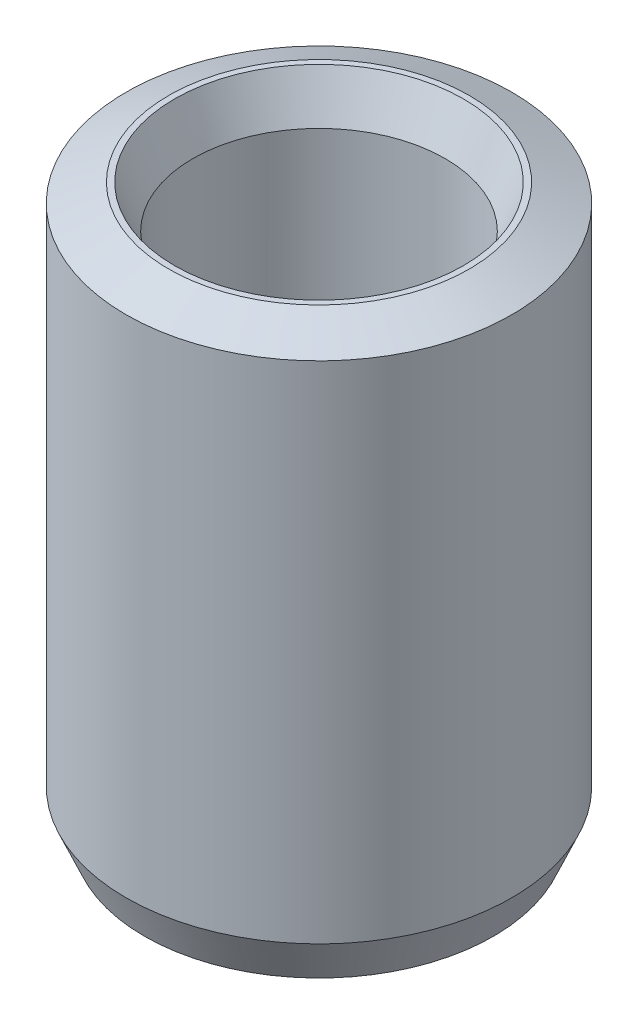
ISO-10303-21;
HEADER;
FILE_DESCRIPTION(('STEP AP214'),'2;1');
FILE_NAME('part.step','',(''),(''),'','','');
FILE_SCHEMA(('AUTOMOTIVE_DESIGN { 1 0 10303 214 1 1 1 1 }'));
ENDSEC;
DATA;
#1=APPLICATION_CONTEXT('core data for automotive mechanical design processes');
#2=APPLICATION_PROTOCOL_DEFINITION('international standard','automotive_design',2000,#1);
#3=PRODUCT_CONTEXT('',#1,'mechanical');
#4=PRODUCT('Part','Part','',(#3));
#5=PRODUCT_RELATED_PRODUCT_CATEGORY('part','',(#4));
#6=PRODUCT_DEFINITION_FORMATION('','',#4);
#7=PRODUCT_DEFINITION_CONTEXT('part definition',#1,'design');
#8=PRODUCT_DEFINITION('design','',#6,#7);
#9=PRODUCT_DEFINITION_SHAPE('','',#8);
#10=(LENGTH_UNIT() NAMED_UNIT(*) SI_UNIT(.MILLI.,.METRE.));
#11=(NAMED_UNIT(*) PLANE_ANGLE_UNIT() SI_UNIT($,.RADIAN.));
#12=(NAMED_UNIT(*) SI_UNIT($,.STERADIAN.) SOLID_ANGLE_UNIT());
#13=UNCERTAINTY_MEASURE_WITH_UNIT(LENGTH_MEASURE(1.E-05),#10,'distance_accuracy_value','');
#14=(GEOMETRIC_REPRESENTATION_CONTEXT(3) GLOBAL_UNCERTAINTY_ASSIGNED_CONTEXT((#13)) GLOBAL_UNIT_ASSIGNED_CONTEXT((#10,
#11,#12)) REPRESENTATION_CONTEXT('',''));
#15=CARTESIAN_POINT('',(0.,0.,0.));
#16=DIRECTION('',(0.,0.,1.));
#17=DIRECTION('',(1.,0.,0.));
#18=AXIS2_PLACEMENT_3D('',#15,#16,#17);
#19=CARTESIAN_POINT('',(0.,102.684958092858,0.));
#20=DIRECTION('',(0.,-1.,0.));
#21=DIRECTION('',(0.,0.,-1.));
#22=AXIS2_PLACEMENT_3D('',#19,#20,#21);
#23=CYLINDRICAL_SURFACE('',#22,35.);
#24=CARTESIAN_POINT('',(0.,7.71480416026316,0.));
#25=DIRECTION('',(0.,1.,0.));
#26=DIRECTION('',(0.,0.,1.));
#27=AXIS2_PLACEMENT_3D('',#24,#25,#26);
#28=CIRCLE('',#27,35.);
#29=CARTESIAN_POINT('',(0.,7.71480416026316,35.));
#30=VERTEX_POINT('',#29);
#31=EDGE_CURVE('E10',#30,#30,#28,.T.);
#32=ORIENTED_EDGE('',*,*,#31,.T.);
#33=EDGE_LOOP('',(#32));
#34=FACE_BOUND('',#33,.T.);
#35=CARTESIAN_POINT('',(0.,99.358945268844,0.));
#36=DIRECTION('',(0.,1.,0.));
#37=DIRECTION('',(0.,0.,1.));
#38=AXIS2_PLACEMENT_3D('',#35,#36,#37);
#39=CIRCLE('',#38,35.);
#40=CARTESIAN_POINT('',(0.,99.3589452688439,-35.));
#41=VERTEX_POINT('',#40);
#42=EDGE_CURVE('E50',#41,#41,#39,.F.);
#43=ORIENTED_EDGE('',*,*,#42,.T.);
#44=EDGE_LOOP('',(#43));
#45=FACE_BOUND('',#44,.T.);
#46=ADVANCED_FACE('F39',(#34,#45),#23,.T.);
#47=CARTESIAN_POINT('',(0.,102.684958092858,0.));
#48=DIRECTION('',(0.,1.,0.));
#49=DIRECTION('',(0.,0.,1.));
#50=AXIS2_PLACEMENT_3D('',#47,#48,#49);
#51=PLANE('',#50);
#52=CARTESIAN_POINT('',(0.,102.684958092858,0.));
#53=DIRECTION('',(0.,1.,0.));
#54=DIRECTION('',(0.,0.,1.));
#55=AXIS2_PLACEMENT_3D('',#52,#53,#54);
#56=CIRCLE('',#55,26.2177838068293);
#57=CARTESIAN_POINT('',(0.,102.684958092858,26.2177838068293));
#58=VERTEX_POINT('',#57);
#59=EDGE_CURVE('E58',#58,#58,#56,.F.);
#60=ORIENTED_EDGE('',*,*,#59,.T.);
#61=EDGE_LOOP('',(#60));
#62=FACE_BOUND('',#61,.T.);
#63=CARTESIAN_POINT('',(0.,102.684958092858,0.));
#64=DIRECTION('',(0.,1.,0.));
#65=DIRECTION('',(0.,0.,1.));
#66=AXIS2_PLACEMENT_3D('',#63,#64,#65);
#67=CIRCLE('',#66,27.2851958397369);
#68=CARTESIAN_POINT('',(0.,102.684958092858,-27.2851958397369));
#69=VERTEX_POINT('',#68);
#70=EDGE_CURVE('E61',#69,#69,#67,.T.);
#71=ORIENTED_EDGE('',*,*,#70,.T.);
#72=EDGE_LOOP('',(#71));
#73=FACE_BOUND('',#72,.T.);
#74=ADVANCED_FACE('F88',(#62,#73),#51,.T.);
#75=CARTESIAN_POINT('',(0.,0.,0.));
#76=DIRECTION('',(0.,1.,0.));
#77=DIRECTION('',(0.,0.,1.));
#78=AXIS2_PLACEMENT_3D('',#75,#76,#77);
#79=PLANE('',#78);
#80=CARTESIAN_POINT('',(0.,0.,0.));
#81=DIRECTION('',(0.,1.,0.));
#82=DIRECTION('',(0.,0.,1.));
#83=AXIS2_PLACEMENT_3D('',#80,#81,#82);
#84=CIRCLE('',#83,30.6065751430781);
#85=CARTESIAN_POINT('',(0.,0.,-30.6065751430781));
#86=VERTEX_POINT('',#85);
#87=EDGE_CURVE('E51',#86,#86,#84,.T.);
#88=ORIENTED_EDGE('',*,*,#87,.T.);
#89=EDGE_LOOP('',(#88));
#90=FACE_BOUND('',#89,.T.);
#91=CARTESIAN_POINT('',(0.,0.,0.));
#92=DIRECTION('',(0.,1.,0.));
#93=DIRECTION('',(0.,0.,1.));
#94=AXIS2_PLACEMENT_3D('',#91,#92,#93);
#95=CIRCLE('',#94,31.6739871759856);
#96=CARTESIAN_POINT('',(0.,0.,31.6739871759856));
#97=VERTEX_POINT('',#96);
#98=EDGE_CURVE('E54',#97,#97,#95,.F.);
#99=ORIENTED_EDGE('',*,*,#98,.T.);
#100=EDGE_LOOP('',(#99));
#101=FACE_BOUND('',#100,.T.);
#102=ADVANCED_FACE('F83',(#90,#101),#79,.F.);
#103=CARTESIAN_POINT('',(0.,102.684958092858,0.));
#104=DIRECTION('',(0.,-1.,0.));
#105=DIRECTION('',(0.,0.,-1.));
#106=AXIS2_PLACEMENT_3D('',#103,#104,#105);
#107=CYLINDRICAL_SURFACE('',#106,22.8917709828149);
#108=CARTESIAN_POINT('',(0.,94.9701539325952,0.));
#109=DIRECTION('',(0.,1.,0.));
#110=DIRECTION('',(0.,0.,1.));
#111=AXIS2_PLACEMENT_3D('',#108,#109,#110);
#112=CIRCLE('',#111,22.8917709828149);
#113=CARTESIAN_POINT('',(0.,94.9701539325952,22.8917709828149));
#114=VERTEX_POINT('',#113);
#115=EDGE_CURVE('E67',#114,#114,#112,.T.);
#116=ORIENTED_EDGE('',*,*,#115,.T.);
#117=EDGE_LOOP('',(#116));
#118=FACE_BOUND('',#117,.T.);
#119=CARTESIAN_POINT('',(0.,3.32601282401442,0.));
#120=DIRECTION('',(0.,1.,0.));
#121=DIRECTION('',(0.,0.,1.));
#122=AXIS2_PLACEMENT_3D('',#119,#120,#121);
#123=CIRCLE('',#122,22.8917709828149);
#124=CARTESIAN_POINT('',(0.,3.32601282401441,-22.8917709828149));
#125=VERTEX_POINT('',#124);
#126=EDGE_CURVE('E69',#125,#125,#123,.F.);
#127=ORIENTED_EDGE('',*,*,#126,.T.);
#128=EDGE_LOOP('',(#127));
#129=FACE_BOUND('',#128,.T.);
#130=ADVANCED_FACE('F71',(#118,#129),#107,.F.);
#131=CARTESIAN_POINT('',(0.,94.9701539325952,0.));
#132=DIRECTION('',(0.,1.,0.));
#133=DIRECTION('',(0.,0.,1.));
#134=AXIS2_PLACEMENT_3D('',#131,#132,#133);
#135=CONICAL_SURFACE('',#134,22.8917709828149,0.407043606954843);
#136=ORIENTED_EDGE('',*,*,#59,.F.);
#137=EDGE_LOOP('',(#136));
#138=FACE_BOUND('',#137,.T.);
#139=ORIENTED_EDGE('',*,*,#115,.F.);
#140=EDGE_LOOP('',(#139));
#141=FACE_BOUND('',#140,.T.);
#142=ADVANCED_FACE('F77',(#138,#141),#135,.F.);
#143=CARTESIAN_POINT('',(0.,0.,0.));
#144=DIRECTION('',(0.,-1.,0.));
#145=DIRECTION('',(0.,0.,-1.));
#146=AXIS2_PLACEMENT_3D('',#143,#144,#145);
#147=CONICAL_SURFACE('',#146,30.6065751430781,1.16375271984006);
#148=CARTESIAN_POINT('',(0.,3.32601282401441,-22.8917709828149));
#149=CARTESIAN_POINT('',(0.,3.2913668570976,-22.972133526151));
#150=CARTESIAN_POINT('',(0.,3.25672089018078,-23.052496069487));
#151=CARTESIAN_POINT('',(0.,3.18742895634715,-23.2132211561592));
#152=CARTESIAN_POINT('',(0.,3.15278298943033,-23.2935836994953));
#153=CARTESIAN_POINT('',(0.,3.0834910555967,-23.4543087861674));
#154=CARTESIAN_POINT('',(0.,3.04884508867988,-23.5346713295035));
#155=CARTESIAN_POINT('',(0.,2.97955315484625,-23.6953964161757));
#156=CARTESIAN_POINT('',(0.,2.94490718792943,-23.7757589595117));
#157=CARTESIAN_POINT('',(0.,2.8756152540958,-23.9364840461839));
#158=CARTESIAN_POINT('',(0.,2.84096928717898,-24.01684658952));
#159=CARTESIAN_POINT('',(0.,2.77167735334535,-24.1775716761921));
#160=CARTESIAN_POINT('',(0.,2.73703138642853,-24.2579342195282));
#161=CARTESIAN_POINT('',(0.,2.6677394525949,-24.4186593062003));
#162=CARTESIAN_POINT('',(0.,2.63309348567808,-24.4990218495364));
#163=CARTESIAN_POINT('',(0.,2.56380155184445,-24.6597469362085));
#164=CARTESIAN_POINT('',(0.,2.52915558492763,-24.7401094795446));
#165=CARTESIAN_POINT('',(0.,2.45986365109399,-24.9008345662168));
#166=CARTESIAN_POINT('',(0.,2.42521768417718,-24.9811971095528));
#167=CARTESIAN_POINT('',(0.,2.35592575034354,-25.141922196225));
#168=CARTESIAN_POINT('',(0.,2.32127978342673,-25.2222847395611));
#169=CARTESIAN_POINT('',(0.,2.25198784959309,-25.3830098262332));
#170=CARTESIAN_POINT('',(0.,2.21734188267628,-25.4633723695693));
#171=CARTESIAN_POINT('',(0.,2.14804994884264,-25.6240974562414));
#172=CARTESIAN_POINT('',(0.,2.11340398192583,-25.7044599995775));
#173=CARTESIAN_POINT('',(0.,2.04411204809219,-25.8651850862497));
#174=CARTESIAN_POINT('',(0.,2.00946608117538,-25.9455476295857));
#175=CARTESIAN_POINT('',(0.,1.94017414734174,-26.1062727162579));
#176=CARTESIAN_POINT('',(0.,1.90552818042493,-26.186635259594));
#177=CARTESIAN_POINT('',(0.,1.83623624659129,-26.3473603462661));
#178=CARTESIAN_POINT('',(0.,1.80159027967447,-26.4277228896022));
#179=CARTESIAN_POINT('',(0.,1.73229834584084,-26.5884479762743));
#180=CARTESIAN_POINT('',(0.,1.69765237892402,-26.6688105196104));
#181=CARTESIAN_POINT('',(0.,1.62836044509039,-26.8295356062826));
#182=CARTESIAN_POINT('',(0.,1.59371447817357,-26.9098981496186));
#183=CARTESIAN_POINT('',(0.,1.52442254433994,-27.0706232362908));
#184=CARTESIAN_POINT('',(0.,1.48977657742312,-27.1509857796269));
#185=CARTESIAN_POINT('',(0.,1.42048464358949,-27.311710866299));
#186=CARTESIAN_POINT('',(0.,1.38583867667267,-27.3920734096351));
#187=CARTESIAN_POINT('',(0.,1.31654674283904,-27.5527984963072));
#188=CARTESIAN_POINT('',(0.,1.28190077592222,-27.6331610396433));
#189=CARTESIAN_POINT('',(0.,1.21260884208859,-27.7938861263155));
#190=CARTESIAN_POINT('',(0.,1.17796287517177,-27.8742486696515));
#191=CARTESIAN_POINT('',(0.,1.10867094133814,-28.0349737563237));
#192=CARTESIAN_POINT('',(0.,1.07402497442132,-28.1153362996598));
#193=CARTESIAN_POINT('',(0.,1.00473304058769,-28.2760613863319));
#194=CARTESIAN_POINT('',(0.,0.970087073670871,-28.356423929668));
#195=CARTESIAN_POINT('',(0.,0.900795139837237,-28.5171490163401));
#196=CARTESIAN_POINT('',(0.,0.866149172920421,-28.5975115596762));
#197=CARTESIAN_POINT('',(0.,0.796857239086787,-28.7582366463484));
#198=CARTESIAN_POINT('',(0.,0.76221127216997,-28.8385991896844));
#199=CARTESIAN_POINT('',(0.,0.692919338336336,-28.9993242763566));
#200=CARTESIAN_POINT('',(0.,0.658273371419519,-29.0796868196927));
#201=CARTESIAN_POINT('',(0.,0.588981437585886,-29.2404119063648));
#202=CARTESIAN_POINT('',(0.,0.554335470669069,-29.3207744497009));
#203=CARTESIAN_POINT('',(0.,0.485043536835436,-29.481499536373));
#204=CARTESIAN_POINT('',(0.,0.450397569918619,-29.5618620797091));
#205=CARTESIAN_POINT('',(0.,0.381105636084985,-29.7225871663813));
#206=CARTESIAN_POINT('',(0.,0.346459669168168,-29.8029497097173));
#207=CARTESIAN_POINT('',(0.,0.277167735334535,-29.9636747963895));
#208=CARTESIAN_POINT('',(0.,0.242521768417718,-30.0440373397256));
#209=CARTESIAN_POINT('',(0.,0.173229834584084,-30.2047624263977));
#210=CARTESIAN_POINT('',(0.,0.138583867667267,-30.2851249697338));
#211=CARTESIAN_POINT('',(0.,0.069291933833634,-30.4458500564059));
#212=CARTESIAN_POINT('',(0.,0.0346459669168174,-30.526212599742));
#213=CARTESIAN_POINT('',(0.,0.,-30.6065751430781));
#214=B_SPLINE_CURVE_WITH_KNOTS('',3,(#148,#149,#150,#151,#152,#153,#154,#155,#156,#157,#158,
#159,#160,#161,#162,#163,#164,#165,#166,#167,#168,#169,#170,#171,#172,#173,#174,#175,#176,#177,
#178,#179,#180,#181,#182,#183,#184,#185,#186,#187,#188,#189,#190,#191,#192,#193,#194,#195,#196,
#197,#198,#199,#200,#201,#202,#203,#204,#205,#206,#207,#208,#209,#210,#211,#212,#213),
.UNSPECIFIED.,.F.,.F.,(4,2,2,2,2,2,2,2,2,2,2,2,2,2,2,2,2,2,2,2,2,2,2,2,2,2,2,2,2,2,2,2,4),(0.,
0.26253824969972,0.525076499399443,0.787614749099164,1.05015299879888,1.31269124849861,
1.57522949819833,1.83776774789805,2.10030599759777,2.36284424729749,2.62538249699721,
2.88792074669693,3.15045899639665,3.41299724609637,3.67553549579609,3.93807374549581,
4.20061199519554,4.46315024489526,4.72568849459498,4.9882267442947,5.25076499399442,
5.51330324369414,5.77584149339386,6.03837974309358,6.3009179927933,6.56345624249302,
6.82599449219274,7.08853274189247,7.35107099159219,7.6136092412919,7.87614749099163,
8.13868574069135,8.40122399039107),.UNSPECIFIED.);
#215=EDGE_CURVE('BSEAM73',#125,#86,#214,.T.);
#216=ORIENTED_EDGE('',*,*,#126,.F.);
#217=ORIENTED_EDGE('',*,*,#87,.F.);
#218=ORIENTED_EDGE('',*,*,#215,.T.);
#219=ORIENTED_EDGE('',*,*,#215,.F.);
#220=EDGE_LOOP('',(#216,#218,#217,#219));
#221=FACE_BOUND('',#220,.T.);
#222=ADVANCED_FACE('F73',(#221),#147,.F.);
#223=CARTESIAN_POINT('',(0.,7.71480416026316,0.));
#224=DIRECTION('',(0.,1.,0.));
#225=DIRECTION('',(0.,0.,1.));
#226=AXIS2_PLACEMENT_3D('',#223,#224,#225);
#227=CONICAL_SURFACE('',#226,35.,0.40704360695484);
#228=ORIENTED_EDGE('',*,*,#98,.F.);
#229=EDGE_LOOP('',(#228));
#230=FACE_BOUND('',#229,.T.);
#231=ORIENTED_EDGE('',*,*,#31,.F.);
#232=EDGE_LOOP('',(#231));
#233=FACE_BOUND('',#232,.T.);
#234=ADVANCED_FACE('F76',(#230,#233),#227,.T.);
#235=CARTESIAN_POINT('',(0.,102.684958092858,0.));
#236=DIRECTION('',(0.,-1.,0.));
#237=DIRECTION('',(0.,0.,-1.));
#238=AXIS2_PLACEMENT_3D('',#235,#236,#237);
#239=CONICAL_SURFACE('',#238,27.2851958397369,1.16375271984005);
#240=CARTESIAN_POINT('',(0.,99.3589452688439,-35.));
#241=CARTESIAN_POINT('',(0.,99.3935912357608,-34.919637456664));
#242=CARTESIAN_POINT('',(0.,99.4282372026776,-34.8392749133279));
#243=CARTESIAN_POINT('',(0.,99.4975291365112,-34.6785498266557));
#244=CARTESIAN_POINT('',(0.,99.532175103428,-34.5981872833197));
#245=CARTESIAN_POINT('',(0.,99.6014670372617,-34.4374621966475));
#246=CARTESIAN_POINT('',(0.,99.6361130041785,-34.3570996533114));
#247=CARTESIAN_POINT('',(0.,99.7054049380121,-34.1963745666393));
#248=CARTESIAN_POINT('',(0.,99.7400509049289,-34.1160120233032));
#249=CARTESIAN_POINT('',(0.,99.8093428387626,-33.9552869366311));
#250=CARTESIAN_POINT('',(0.,99.8439888056794,-33.874924393295));
#251=CARTESIAN_POINT('',(0.,99.913280739513,-33.7141993066228));
#252=CARTESIAN_POINT('',(0.,99.9479267064298,-33.6338367632868));
#253=CARTESIAN_POINT('',(0.,100.017218640263,-33.4731116766146));
#254=CARTESIAN_POINT('',(0.,100.05186460718,-33.3927491332785));
#255=CARTESIAN_POINT('',(0.,100.121156541014,-33.2320240466064));
#256=CARTESIAN_POINT('',(0.,100.155802507931,-33.1516615032703));
#257=CARTESIAN_POINT('',(0.,100.225094441764,-32.9909364165982));
#258=CARTESIAN_POINT('',(0.,100.259740408681,-32.9105738732621));
#259=CARTESIAN_POINT('',(0.,100.329032342515,-32.74984878659));
#260=CARTESIAN_POINT('',(0.,100.363678309432,-32.6694862432539));
#261=CARTESIAN_POINT('',(0.,100.432970243265,-32.5087611565817));
#262=CARTESIAN_POINT('',(0.,100.467616210182,-32.4283986132457));
#263=CARTESIAN_POINT('',(0.,100.536908144016,-32.2676735265735));
#264=CARTESIAN_POINT('',(0.,100.571554110933,-32.1873109832374));
#265=CARTESIAN_POINT('',(0.,100.640846044766,-32.0265858965653));
#266=CARTESIAN_POINT('',(0.,100.675492011683,-31.9462233532292));
#267=CARTESIAN_POINT('',(0.,100.744783945517,-31.7854982665571));
#268=CARTESIAN_POINT('',(0.,100.779429912433,-31.705135723221));
#269=CARTESIAN_POINT('',(0.,100.848721846267,-31.5444106365488));
#270=CARTESIAN_POINT('',(0.,100.883367813184,-31.4640480932128));
#271=CARTESIAN_POINT('',(0.,100.952659747018,-31.3033230065406));
#272=CARTESIAN_POINT('',(0.,100.987305713934,-31.2229604632045));
#273=CARTESIAN_POINT('',(0.,101.056597647768,-31.0622353765324));
#274=CARTESIAN_POINT('',(0.,101.091243614685,-30.9818728331963));
#275=CARTESIAN_POINT('',(0.,101.160535548518,-30.8211477465242));
#276=CARTESIAN_POINT('',(0.,101.195181515435,-30.7407852031881));
#277=CARTESIAN_POINT('',(0.,101.264473449269,-30.5800601165159));
#278=CARTESIAN_POINT('',(0.,101.299119416186,-30.4996975731799));
#279=CARTESIAN_POINT('',(0.,101.368411350019,-30.3389724865077));
#280=CARTESIAN_POINT('',(0.,101.403057316936,-30.2586099431716));
#281=CARTESIAN_POINT('',(0.,101.47234925077,-30.0978848564995));
#282=CARTESIAN_POINT('',(0.,101.506995217687,-30.0175223131634));
#283=CARTESIAN_POINT('',(0.,101.57628715152,-29.8567972264913));
#284=CARTESIAN_POINT('',(0.,101.610933118437,-29.7764346831552));
#285=CARTESIAN_POINT('',(0.,101.680225052271,-29.615709596483));
#286=CARTESIAN_POINT('',(0.,101.714871019187,-29.535347053147));
#287=CARTESIAN_POINT('',(0.,101.784162953021,-29.3746219664748));
#288=CARTESIAN_POINT('',(0.,101.818808919938,-29.2942594231388));
#289=CARTESIAN_POINT('',(0.,101.888100853772,-29.1335343364666));
#290=CARTESIAN_POINT('',(0.,101.922746820688,-29.0531717931305));
#291=CARTESIAN_POINT('',(0.,101.992038754522,-28.8924467064584));
#292=CARTESIAN_POINT('',(0.,102.026684721439,-28.8120841631223));
#293=CARTESIAN_POINT('',(0.,102.095976655272,-28.6513590764502));
#294=CARTESIAN_POINT('',(0.,102.130622622189,-28.5709965331141));
#295=CARTESIAN_POINT('',(0.,102.199914556023,-28.4102714464419));
#296=CARTESIAN_POINT('',(0.,102.23456052294,-28.3299089031059));
#297=CARTESIAN_POINT('',(0.,102.303852456773,-28.1691838164337));
#298=CARTESIAN_POINT('',(0.,102.33849842369,-28.0888212730976));
#299=CARTESIAN_POINT('',(0.,102.407790357524,-27.9280961864255));
#300=CARTESIAN_POINT('',(0.,102.442436324441,-27.8477336430894));
#301=CARTESIAN_POINT('',(0.,102.511728258274,-27.6870085564173));
#302=CARTESIAN_POINT('',(0.,102.546374225191,-27.6066460130812));
#303=CARTESIAN_POINT('',(0.,102.615666159025,-27.445920926409));
#304=CARTESIAN_POINT('',(0.,102.650312125942,-27.365558383073));
#305=CARTESIAN_POINT('',(0.,102.684958092858,-27.2851958397369));
#306=B_SPLINE_CURVE_WITH_KNOTS('',3,(#240,#241,#242,#243,#244,#245,#246,#247,#248,#249,#250,
#251,#252,#253,#254,#255,#256,#257,#258,#259,#260,#261,#262,#263,#264,#265,#266,#267,#268,#269,
#270,#271,#272,#273,#274,#275,#276,#277,#278,#279,#280,#281,#282,#283,#284,#285,#286,#287,#288,
#289,#290,#291,#292,#293,#294,#295,#296,#297,#298,#299,#300,#301,#302,#303,#304,#305),
.UNSPECIFIED.,.F.,.F.,(4,2,2,2,2,2,2,2,2,2,2,2,2,2,2,2,2,2,2,2,2,2,2,2,2,2,2,2,2,2,2,2,4),(0.,
0.262538249699727,0.525076499399441,0.787614749099168,1.05015299879888,1.31269124849861,
1.57522949819832,1.83776774789804,2.10030599759777,2.36284424729748,2.6253824969972,
2.88792074669692,3.15045899639664,3.41299724609636,3.67553549579608,3.9380737454958,
4.20061199519552,4.46315024489524,4.72568849459496,4.98822674429468,5.2507649939944,
5.51330324369412,5.77584149339383,6.03837974309356,6.30091799279328,6.563456242493,
6.82599449219272,7.08853274189243,7.35107099159215,7.61360924129187,7.8761474909916,
8.13868574069131,8.40122399039103),.UNSPECIFIED.);
#307=EDGE_CURVE('BSEAM45',#41,#69,#306,.T.);
#308=ORIENTED_EDGE('',*,*,#42,.F.);
#309=ORIENTED_EDGE('',*,*,#70,.F.);
#310=ORIENTED_EDGE('',*,*,#307,.T.);
#311=ORIENTED_EDGE('',*,*,#307,.F.);
#312=EDGE_LOOP('',(#308,#310,#309,#311));
#313=FACE_BOUND('',#312,.T.);
#314=ADVANCED_FACE('F45',(#313),#239,.T.);
#315=CLOSED_SHELL('',(#46,#74,#102,#130,#142,#222,#234,#314));
#316=MANIFOLD_SOLID_BREP('B2',#315);
#317=ADVANCED_BREP_SHAPE_REPRESENTATION('',(#18,#316),#14);
#318=SHAPE_DEFINITION_REPRESENTATION(#9,#317);
ENDSEC;
END-ISO-10303-21;
